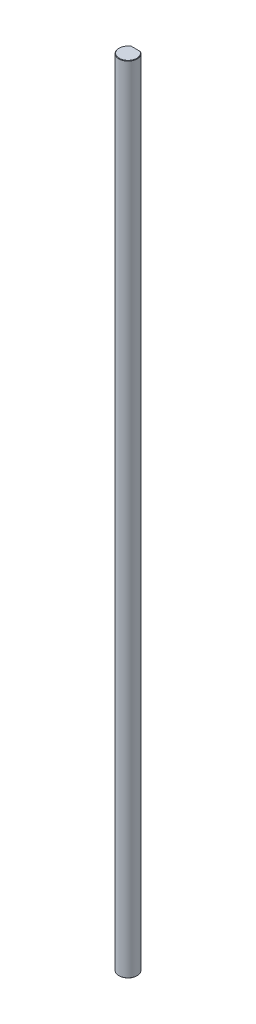
ISO-10303-21;
HEADER;
FILE_DESCRIPTION(('STEP AP214'),'2;1');
FILE_NAME('part.step','',(''),(''),'','','');
FILE_SCHEMA(('AUTOMOTIVE_DESIGN { 1 0 10303 214 1 1 1 1 }'));
ENDSEC;
DATA;
#1=APPLICATION_CONTEXT('core data for automotive mechanical design processes');
#2=APPLICATION_PROTOCOL_DEFINITION('international standard','automotive_design',2000,#1);
#3=PRODUCT_CONTEXT('',#1,'mechanical');
#4=PRODUCT('Part','Part','',(#3));
#5=PRODUCT_RELATED_PRODUCT_CATEGORY('part','',(#4));
#6=PRODUCT_DEFINITION_FORMATION('','',#4);
#7=PRODUCT_DEFINITION_CONTEXT('part definition',#1,'design');
#8=PRODUCT_DEFINITION('design','',#6,#7);
#9=PRODUCT_DEFINITION_SHAPE('','',#8);
#10=(LENGTH_UNIT() NAMED_UNIT(*) SI_UNIT(.MILLI.,.METRE.));
#11=(NAMED_UNIT(*) PLANE_ANGLE_UNIT() SI_UNIT($,.RADIAN.));
#12=(NAMED_UNIT(*) SI_UNIT($,.STERADIAN.) SOLID_ANGLE_UNIT());
#13=UNCERTAINTY_MEASURE_WITH_UNIT(LENGTH_MEASURE(1.E-05),#10,'distance_accuracy_value','');
#14=(GEOMETRIC_REPRESENTATION_CONTEXT(3) GLOBAL_UNCERTAINTY_ASSIGNED_CONTEXT((#13)) GLOBAL_UNIT_ASSIGNED_CONTEXT((#10,
#11,#12)) REPRESENTATION_CONTEXT('',''));
#15=CARTESIAN_POINT('',(0.,0.,0.));
#16=DIRECTION('',(0.,0.,1.));
#17=DIRECTION('',(1.,0.,0.));
#18=AXIS2_PLACEMENT_3D('',#15,#16,#17);
#19=CARTESIAN_POINT('',(0.,260.,0.));
#20=DIRECTION('',(0.,-1.,0.));
#21=DIRECTION('',(0.,0.,-1.));
#22=AXIS2_PLACEMENT_3D('',#19,#20,#21);
#23=CONICAL_SURFACE('',#22,2.875,0.785398163397662);
#24=CARTESIAN_POINT('',(-1.6583123951777,259.875,-2.5));
#25=CARTESIAN_POINT('',(-1.57973572193477,259.918434890403,-2.5));
#26=CARTESIAN_POINT('',(-1.50022900034243,259.960246696465,-2.5));
#27=CARTESIAN_POINT('',(-1.4197270864501,260.,-2.5));
#28=(BOUNDED_CURVE() B_SPLINE_CURVE(3,(#24,#25,#26,#27),.UNSPECIFIED.,.F.,
.F.) B_SPLINE_CURVE_WITH_KNOTS((4,4),(0.,0.000269347265701034),
.UNSPECIFIED.) CURVE() GEOMETRIC_REPRESENTATION_ITEM() RATIONAL_B_SPLINE_CURVE((1.,1.,1.,1.)) REPRESENTATION_ITEM(''));
#29=CARTESIAN_POINT('',(-1.6583123951777,259.875,-2.5));
#30=VERTEX_POINT('',#29);
#31=CARTESIAN_POINT('',(-1.4197270864501,260.,-2.5));
#32=VERTEX_POINT('',#31);
#33=EDGE_CURVE('E128',#30,#32,#28,.T.);
#34=ORIENTED_EDGE('',*,*,#33,.F.);
#35=CARTESIAN_POINT('',(0.,259.875,0.));
#36=DIRECTION('',(0.,-1.,0.));
#37=DIRECTION('',(0.,0.,1.));
#38=AXIS2_PLACEMENT_3D('',#35,#36,#37);
#39=CIRCLE('',#38,3.);
#40=CARTESIAN_POINT('',(1.6583123951777,259.875,-2.5));
#41=VERTEX_POINT('',#40);
#42=EDGE_CURVE('E83',#41,#30,#39,.T.);
#43=ORIENTED_EDGE('',*,*,#42,.F.);
#44=CARTESIAN_POINT('',(1.4197270864501,260.,-2.5));
#45=CARTESIAN_POINT('',(1.50022900034241,259.960246696465,-2.5));
#46=CARTESIAN_POINT('',(1.57973572193477,259.918434890403,-2.5));
#47=CARTESIAN_POINT('',(1.6583123951777,259.875,-2.5));
#48=(BOUNDED_CURVE() B_SPLINE_CURVE(3,(#44,#45,#46,#47),.UNSPECIFIED.,.F.,
.F.) B_SPLINE_CURVE_WITH_KNOTS((4,4),(0.,0.000269347265701041),
.UNSPECIFIED.) CURVE() GEOMETRIC_REPRESENTATION_ITEM() RATIONAL_B_SPLINE_CURVE((1.,1.,1.,1.)) REPRESENTATION_ITEM(''));
#49=CARTESIAN_POINT('',(1.4197270864501,260.,-2.5));
#50=VERTEX_POINT('',#49);
#51=EDGE_CURVE('E127',#50,#41,#48,.T.);
#52=ORIENTED_EDGE('',*,*,#51,.F.);
#53=CARTESIAN_POINT('',(0.,260.,0.));
#54=DIRECTION('',(0.,1.,0.));
#55=DIRECTION('',(0.,0.,1.));
#56=AXIS2_PLACEMENT_3D('',#53,#54,#55);
#57=CIRCLE('',#56,2.875);
#58=EDGE_CURVE('E26',#32,#50,#57,.T.);
#59=ORIENTED_EDGE('',*,*,#58,.F.);
#60=EDGE_LOOP('',(#34,#43,#52,#59));
#61=FACE_BOUND('',#60,.T.);
#62=ADVANCED_FACE('F15',(#61),#23,.T.);
#63=CARTESIAN_POINT('',(0.,0.125000000000097,0.));
#64=DIRECTION('',(0.,1.,0.));
#65=DIRECTION('',(0.,0.,1.));
#66=AXIS2_PLACEMENT_3D('',#63,#64,#65);
#67=CONICAL_SURFACE('',#66,3.,0.785398163397327);
#68=DIRECTION('',(0.,0.707106781186633,0.707106781186462));
#69=VECTOR('',#68,1.);
#70=CARTESIAN_POINT('',(0.,0.125000000000097,3.));
#71=LINE('',#70,#69);
#72=CARTESIAN_POINT('',(0.,0.,2.87499999999993));
#73=VERTEX_POINT('',#72);
#74=CARTESIAN_POINT('',(0.,0.125000000000097,3.));
#75=VERTEX_POINT('',#74);
#76=EDGE_CURVE('E19',#73,#75,#71,.T.);
#77=ORIENTED_EDGE('',*,*,#76,.F.);
#78=CARTESIAN_POINT('',(0.,0.,0.));
#79=DIRECTION('',(0.,-1.,0.));
#80=DIRECTION('',(0.,0.,1.));
#81=AXIS2_PLACEMENT_3D('',#78,#79,#80);
#82=CIRCLE('',#81,2.87499999999993);
#83=CARTESIAN_POINT('',(1.41972708644993,0.,-2.5));
#84=VERTEX_POINT('',#83);
#85=EDGE_CURVE('E9',#84,#73,#82,.T.);
#86=ORIENTED_EDGE('',*,*,#85,.F.);
#87=CARTESIAN_POINT('',(1.6583123951777,0.125000000000097,-2.5));
#88=CARTESIAN_POINT('',(1.57973572193472,0.0815651095965285,-2.5));
#89=CARTESIAN_POINT('',(1.50022900034231,0.0397533035353066,-2.5));
#90=CARTESIAN_POINT('',(1.41972708644993,0.,-2.5));
#91=(BOUNDED_CURVE() B_SPLINE_CURVE(3,(#87,#88,#89,#90),.UNSPECIFIED.,.F.,
.F.) B_SPLINE_CURVE_WITH_KNOTS((4,4),(0.,0.000269347265701265),
.UNSPECIFIED.) CURVE() GEOMETRIC_REPRESENTATION_ITEM() RATIONAL_B_SPLINE_CURVE((1.,1.,1.,1.)) REPRESENTATION_ITEM(''));
#92=CARTESIAN_POINT('',(1.6583123951777,0.125000000000097,-2.5));
#93=VERTEX_POINT('',#92);
#94=EDGE_CURVE('E130',#93,#84,#91,.T.);
#95=ORIENTED_EDGE('',*,*,#94,.F.);
#96=CARTESIAN_POINT('',(0.,0.125000000000097,0.));
#97=DIRECTION('',(0.,1.,0.));
#98=DIRECTION('',(0.,0.,1.));
#99=AXIS2_PLACEMENT_3D('',#96,#97,#98);
#100=CIRCLE('',#99,3.);
#101=EDGE_CURVE('E87',#75,#93,#100,.T.);
#102=ORIENTED_EDGE('',*,*,#101,.F.);
#103=EDGE_LOOP('',(#77,#86,#95,#102));
#104=FACE_BOUND('',#103,.T.);
#105=ADVANCED_FACE('F145',(#104),#67,.T.);
#106=CARTESIAN_POINT('',(0.,0.,0.));
#107=DIRECTION('',(0.,1.,0.));
#108=DIRECTION('',(1.,0.,0.));
#109=AXIS2_PLACEMENT_3D('',#106,#107,#108);
#110=PLANE('',#109);
#111=DIRECTION('',(1.,0.,0.));
#112=VECTOR('',#111,1.);
#113=CARTESIAN_POINT('',(0.,0.,-2.5));
#114=LINE('',#113,#112);
#115=CARTESIAN_POINT('',(-1.41972708644993,0.,-2.5));
#116=VERTEX_POINT('',#115);
#117=EDGE_CURVE('E95',#116,#84,#114,.T.);
#118=ORIENTED_EDGE('',*,*,#117,.T.);
#119=ORIENTED_EDGE('',*,*,#85,.T.);
#120=CARTESIAN_POINT('',(0.,0.,0.));
#121=DIRECTION('',(0.,-1.,0.));
#122=DIRECTION('',(0.,0.,1.));
#123=AXIS2_PLACEMENT_3D('',#120,#121,#122);
#124=CIRCLE('',#123,2.87499999999993);
#125=EDGE_CURVE('E109',#73,#116,#124,.T.);
#126=ORIENTED_EDGE('',*,*,#125,.T.);
#127=EDGE_LOOP('',(#118,#119,#126));
#128=FACE_BOUND('',#127,.T.);
#129=ADVANCED_FACE('F165',(#128),#110,.F.);
#130=CARTESIAN_POINT('',(0.,260.,0.));
#131=DIRECTION('',(0.,1.,0.));
#132=DIRECTION('',(1.,0.,0.));
#133=AXIS2_PLACEMENT_3D('',#130,#131,#132);
#134=PLANE('',#133);
#135=DIRECTION('',(1.,0.,0.));
#136=VECTOR('',#135,1.);
#137=CARTESIAN_POINT('',(0.,260.,-2.5));
#138=LINE('',#137,#136);
#139=EDGE_CURVE('E123',#32,#50,#138,.T.);
#140=ORIENTED_EDGE('',*,*,#139,.F.);
#141=ORIENTED_EDGE('',*,*,#58,.T.);
#142=EDGE_LOOP('',(#140,#141));
#143=FACE_BOUND('',#142,.T.);
#144=ADVANCED_FACE('F245',(#143),#134,.T.);
#145=CARTESIAN_POINT('',(0.,260.,-2.5));
#146=DIRECTION('',(0.,0.,-1.));
#147=DIRECTION('',(0.,-1.,0.));
#148=AXIS2_PLACEMENT_3D('',#145,#146,#147);
#149=PLANE('',#148);
#150=DIRECTION('',(0.,-1.,0.));
#151=VECTOR('',#150,1.);
#152=CARTESIAN_POINT('',(1.6583123951777,260.,-2.5));
#153=LINE('',#152,#151);
#154=EDGE_CURVE('E120',#41,#93,#153,.T.);
#155=ORIENTED_EDGE('',*,*,#154,.T.);
#156=ORIENTED_EDGE('',*,*,#94,.T.);
#157=ORIENTED_EDGE('',*,*,#117,.F.);
#158=CARTESIAN_POINT('',(-1.41972708644993,0.,-2.5));
#159=CARTESIAN_POINT('',(-1.5002290003423,0.0397533035353308,-2.5));
#160=CARTESIAN_POINT('',(-1.57973572193472,0.0815651095965163,-2.5));
#161=CARTESIAN_POINT('',(-1.6583123951777,0.125000000000097,-2.5));
#162=(BOUNDED_CURVE() B_SPLINE_CURVE(3,(#158,#159,#160,#161),.UNSPECIFIED.,.F.,
.F.) B_SPLINE_CURVE_WITH_KNOTS((4,4),(0.,0.000269347265701265),
.UNSPECIFIED.) CURVE() GEOMETRIC_REPRESENTATION_ITEM() RATIONAL_B_SPLINE_CURVE((1.,1.,1.,1.)) REPRESENTATION_ITEM(''));
#163=CARTESIAN_POINT('',(-1.6583123951777,0.125000000000097,-2.5));
#164=VERTEX_POINT('',#163);
#165=EDGE_CURVE('E88',#116,#164,#162,.T.);
#166=ORIENTED_EDGE('',*,*,#165,.T.);
#167=DIRECTION('',(0.,-1.,0.));
#168=VECTOR('',#167,1.);
#169=CARTESIAN_POINT('',(-1.6583123951777,260.,-2.5));
#170=LINE('',#169,#168);
#171=EDGE_CURVE('E75',#30,#164,#170,.T.);
#172=ORIENTED_EDGE('',*,*,#171,.F.);
#173=ORIENTED_EDGE('',*,*,#33,.T.);
#174=ORIENTED_EDGE('',*,*,#139,.T.);
#175=ORIENTED_EDGE('',*,*,#51,.T.);
#176=EDGE_LOOP('',(#155,#156,#157,#166,#172,#173,#174,#175));
#177=FACE_BOUND('',#176,.T.);
#178=ADVANCED_FACE('F92',(#177),#149,.T.);
#179=CARTESIAN_POINT('',(0.,260.,0.));
#180=DIRECTION('',(0.,-1.,0.));
#181=DIRECTION('',(0.,0.,-1.));
#182=AXIS2_PLACEMENT_3D('',#179,#180,#181);
#183=CYLINDRICAL_SURFACE('',#182,3.);
#184=ORIENTED_EDGE('',*,*,#171,.T.);
#185=CARTESIAN_POINT('',(0.,0.125000000000097,0.));
#186=DIRECTION('',(0.,1.,0.));
#187=DIRECTION('',(0.,0.,1.));
#188=AXIS2_PLACEMENT_3D('',#185,#186,#187);
#189=CIRCLE('',#188,3.);
#190=EDGE_CURVE('E79',#164,#75,#189,.T.);
#191=ORIENTED_EDGE('',*,*,#190,.T.);
#192=ORIENTED_EDGE('',*,*,#101,.T.);
#193=ORIENTED_EDGE('',*,*,#154,.F.);
#194=ORIENTED_EDGE('',*,*,#42,.T.);
#195=EDGE_LOOP('',(#184,#191,#192,#193,#194));
#196=FACE_BOUND('',#195,.T.);
#197=ADVANCED_FACE('F17',(#196),#183,.T.);
#198=CARTESIAN_POINT('',(0.,0.125000000000097,0.));
#199=DIRECTION('',(0.,1.,0.));
#200=DIRECTION('',(0.,0.,1.));
#201=AXIS2_PLACEMENT_3D('',#198,#199,#200);
#202=CONICAL_SURFACE('',#201,3.,0.785398163397327);
#203=ORIENTED_EDGE('',*,*,#125,.F.);
#204=ORIENTED_EDGE('',*,*,#76,.T.);
#205=ORIENTED_EDGE('',*,*,#190,.F.);
#206=ORIENTED_EDGE('',*,*,#165,.F.);
#207=EDGE_LOOP('',(#203,#204,#205,#206));
#208=FACE_BOUND('',#207,.T.);
#209=ADVANCED_FACE('F101',(#208),#202,.T.);
#210=CLOSED_SHELL('',(#62,#105,#129,#144,#178,#197,#209));
#211=MANIFOLD_SOLID_BREP('B1',#210);
#212=ADVANCED_BREP_SHAPE_REPRESENTATION('',(#18,#211),#14);
#213=SHAPE_DEFINITION_REPRESENTATION(#9,#212);
ENDSEC;
END-ISO-10303-21;
